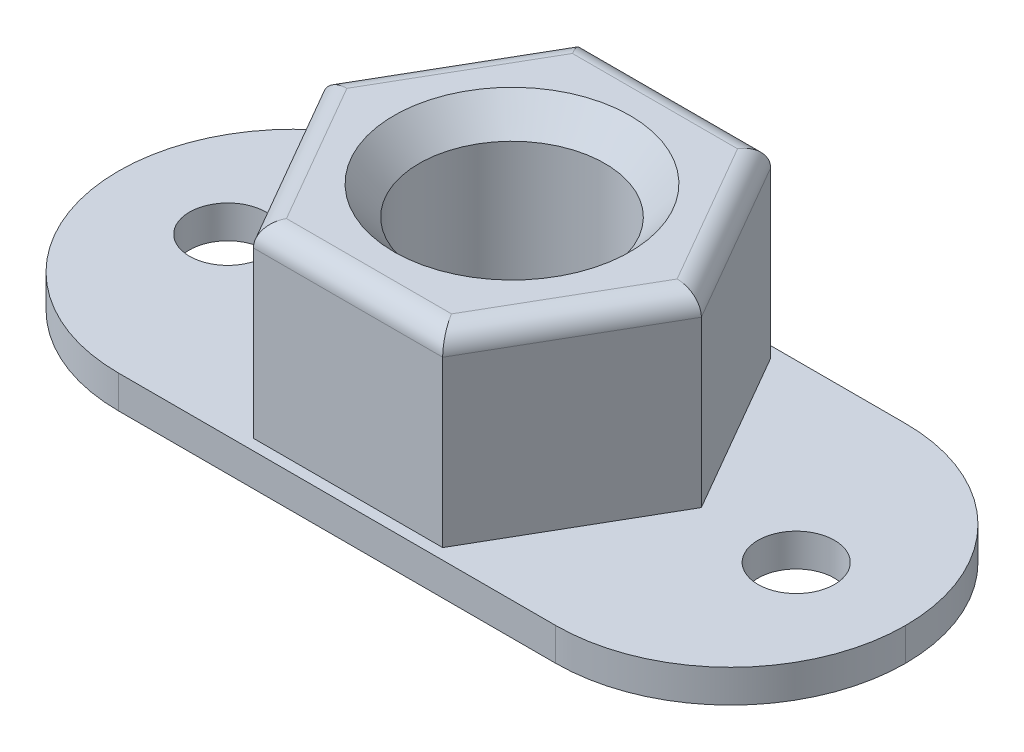
ISO-10303-21;
HEADER;
FILE_DESCRIPTION(('STEP AP214'),'2;1');
FILE_NAME('part.step','',(''),(''),'','','');
FILE_SCHEMA(('AUTOMOTIVE_DESIGN { 1 0 10303 214 1 1 1 1 }'));
ENDSEC;
DATA;
#1=APPLICATION_CONTEXT('core data for automotive mechanical design processes');
#2=APPLICATION_PROTOCOL_DEFINITION('international standard','automotive_design',2000,#1);
#3=PRODUCT_CONTEXT('',#1,'mechanical');
#4=PRODUCT('Part','Part','',(#3));
#5=PRODUCT_RELATED_PRODUCT_CATEGORY('part','',(#4));
#6=PRODUCT_DEFINITION_FORMATION('','',#4);
#7=PRODUCT_DEFINITION_CONTEXT('part definition',#1,'design');
#8=PRODUCT_DEFINITION('design','',#6,#7);
#9=PRODUCT_DEFINITION_SHAPE('','',#8);
#10=(LENGTH_UNIT() NAMED_UNIT(*) SI_UNIT(.MILLI.,.METRE.));
#11=(NAMED_UNIT(*) PLANE_ANGLE_UNIT() SI_UNIT($,.RADIAN.));
#12=(NAMED_UNIT(*) SI_UNIT($,.STERADIAN.) SOLID_ANGLE_UNIT());
#13=UNCERTAINTY_MEASURE_WITH_UNIT(LENGTH_MEASURE(1.E-05),#10,'distance_accuracy_value','');
#14=(GEOMETRIC_REPRESENTATION_CONTEXT(3) GLOBAL_UNCERTAINTY_ASSIGNED_CONTEXT((#13)) GLOBAL_UNIT_ASSIGNED_CONTEXT((#10,
#11,#12)) REPRESENTATION_CONTEXT('',''));
#15=CARTESIAN_POINT('',(0.,0.,0.));
#16=DIRECTION('',(0.,0.,1.));
#17=DIRECTION('',(1.,0.,0.));
#18=AXIS2_PLACEMENT_3D('',#15,#16,#17);
#19=CARTESIAN_POINT('',(6.87407664253899,13.49375,11.90625));
#20=DIRECTION('',(-0.866025403784438,0.,-0.5));
#21=DIRECTION('',(-0.5,0.,0.866025403784439));
#22=AXIS2_PLACEMENT_3D('',#19,#20,#21);
#23=PLANE('',#22);
#24=DIRECTION('',(0.,-1.,0.));
#25=VECTOR('',#24,1.);
#26=CARTESIAN_POINT('',(13.748153285078,13.49375,0.));
#27=LINE('',#26,#25);
#28=CARTESIAN_POINT('',(13.748153285078,11.96975,0.));
#29=VERTEX_POINT('',#28);
#30=CARTESIAN_POINT('',(13.748153285078,0.,0.));
#31=VERTEX_POINT('',#30);
#32=EDGE_CURVE('E155',#29,#31,#27,.T.);
#33=ORIENTED_EDGE('',*,*,#32,.F.);
#34=DIRECTION('',(0.5,0.,-0.866025403784439));
#35=VECTOR('',#34,1.);
#36=CARTESIAN_POINT('',(6.87407664253899,11.96975,11.90625));
#37=LINE('',#36,#35);
#38=CARTESIAN_POINT('',(6.87407664253899,11.96975,11.90625));
#39=VERTEX_POINT('',#38);
#40=EDGE_CURVE('E211',#29,#39,#37,.F.);
#41=ORIENTED_EDGE('',*,*,#40,.T.);
#42=DIRECTION('',(0.,-1.,0.));
#43=VECTOR('',#42,1.);
#44=CARTESIAN_POINT('',(6.87407664253899,13.49375,11.90625));
#45=LINE('',#44,#43);
#46=CARTESIAN_POINT('',(6.87407664253899,0.,11.90625));
#47=VERTEX_POINT('',#46);
#48=EDGE_CURVE('E165',#39,#47,#45,.T.);
#49=ORIENTED_EDGE('',*,*,#48,.T.);
#50=DIRECTION('',(0.5,0.,-0.866025403784438));
#51=VECTOR('',#50,1.);
#52=CARTESIAN_POINT('',(6.87407664253899,0.,11.90625));
#53=LINE('',#52,#51);
#54=EDGE_CURVE('E146',#47,#31,#53,.T.);
#55=ORIENTED_EDGE('',*,*,#54,.T.);
#56=EDGE_LOOP('',(#33,#41,#49,#55));
#57=FACE_BOUND('',#56,.T.);
#58=ADVANCED_FACE('F34',(#57),#23,.F.);
#59=CARTESIAN_POINT('',(13.748153285078,13.49375,0.));
#60=DIRECTION('',(-0.866025403784438,0.,0.5));
#61=DIRECTION('',(0.5,0.,0.866025403784439));
#62=AXIS2_PLACEMENT_3D('',#59,#60,#61);
#63=PLANE('',#62);
#64=DIRECTION('',(0.,-1.,0.));
#65=VECTOR('',#64,1.);
#66=CARTESIAN_POINT('',(6.87407664253898,13.49375,-11.90625));
#67=LINE('',#66,#65);
#68=CARTESIAN_POINT('',(6.87407664253898,11.96975,-11.90625));
#69=VERTEX_POINT('',#68);
#70=CARTESIAN_POINT('',(6.87407664253898,0.,-11.90625));
#71=VERTEX_POINT('',#70);
#72=EDGE_CURVE('E162',#69,#71,#67,.T.);
#73=ORIENTED_EDGE('',*,*,#72,.F.);
#74=DIRECTION('',(-0.5,0.,-0.866025403784439));
#75=VECTOR('',#74,1.);
#76=CARTESIAN_POINT('',(13.748153285078,11.96975,0.));
#77=LINE('',#76,#75);
#78=EDGE_CURVE('E158',#69,#29,#77,.F.);
#79=ORIENTED_EDGE('',*,*,#78,.T.);
#80=ORIENTED_EDGE('',*,*,#32,.T.);
#81=DIRECTION('',(-0.5,0.,-0.866025403784439));
#82=VECTOR('',#81,1.);
#83=CARTESIAN_POINT('',(13.748153285078,0.,0.));
#84=LINE('',#83,#82);
#85=EDGE_CURVE('E142',#31,#71,#84,.T.);
#86=ORIENTED_EDGE('',*,*,#85,.T.);
#87=EDGE_LOOP('',(#73,#79,#80,#86));
#88=FACE_BOUND('',#87,.T.);
#89=ADVANCED_FACE('F156',(#88),#63,.F.);
#90=CARTESIAN_POINT('',(6.87407664253898,13.49375,-11.90625));
#91=DIRECTION('',(0.,0.,1.));
#92=DIRECTION('',(1.,0.,0.));
#93=AXIS2_PLACEMENT_3D('',#90,#91,#92);
#94=PLANE('',#93);
#95=DIRECTION('',(0.,-1.,0.));
#96=VECTOR('',#95,1.);
#97=CARTESIAN_POINT('',(-6.87407664253898,13.49375,-11.90625));
#98=LINE('',#97,#96);
#99=CARTESIAN_POINT('',(-6.87407664253898,11.96975,-11.90625));
#100=VERTEX_POINT('',#99);
#101=CARTESIAN_POINT('',(-6.87407664253898,0.,-11.90625));
#102=VERTEX_POINT('',#101);
#103=EDGE_CURVE('E191',#100,#102,#98,.T.);
#104=ORIENTED_EDGE('',*,*,#103,.F.);
#105=DIRECTION('',(-1.,0.,0.));
#106=VECTOR('',#105,1.);
#107=CARTESIAN_POINT('',(6.87407664253898,11.96975,-11.90625));
#108=LINE('',#107,#106);
#109=EDGE_CURVE('E207',#100,#69,#108,.F.);
#110=ORIENTED_EDGE('',*,*,#109,.T.);
#111=ORIENTED_EDGE('',*,*,#72,.T.);
#112=DIRECTION('',(-1.,0.,0.));
#113=VECTOR('',#112,1.);
#114=CARTESIAN_POINT('',(6.87407664253898,0.,-11.90625));
#115=LINE('',#114,#113);
#116=EDGE_CURVE('E149',#71,#102,#115,.T.);
#117=ORIENTED_EDGE('',*,*,#116,.T.);
#118=EDGE_LOOP('',(#104,#110,#111,#117));
#119=FACE_BOUND('',#118,.T.);
#120=ADVANCED_FACE('F317',(#119),#94,.F.);
#121=CARTESIAN_POINT('',(-6.87407664253898,13.49375,-11.90625));
#122=DIRECTION('',(0.866025403784439,0.,0.5));
#123=DIRECTION('',(0.5,0.,-0.866025403784439));
#124=AXIS2_PLACEMENT_3D('',#121,#122,#123);
#125=PLANE('',#124);
#126=DIRECTION('',(0.,-1.,0.));
#127=VECTOR('',#126,1.);
#128=CARTESIAN_POINT('',(-13.748153285078,13.49375,0.));
#129=LINE('',#128,#127);
#130=CARTESIAN_POINT('',(-13.748153285078,11.96975,0.));
#131=VERTEX_POINT('',#130);
#132=CARTESIAN_POINT('',(-13.748153285078,0.,0.));
#133=VERTEX_POINT('',#132);
#134=EDGE_CURVE('E188',#131,#133,#129,.T.);
#135=ORIENTED_EDGE('',*,*,#134,.F.);
#136=DIRECTION('',(-0.5,0.,0.866025403784439));
#137=VECTOR('',#136,1.);
#138=CARTESIAN_POINT('',(-6.87407664253898,11.96975,-11.90625));
#139=LINE('',#138,#137);
#140=EDGE_CURVE('E217',#131,#100,#139,.F.);
#141=ORIENTED_EDGE('',*,*,#140,.T.);
#142=ORIENTED_EDGE('',*,*,#103,.T.);
#143=DIRECTION('',(-0.5,0.,0.866025403784439));
#144=VECTOR('',#143,1.);
#145=CARTESIAN_POINT('',(-6.87407664253898,0.,-11.90625));
#146=LINE('',#145,#144);
#147=EDGE_CURVE('E176',#102,#133,#146,.T.);
#148=ORIENTED_EDGE('',*,*,#147,.T.);
#149=EDGE_LOOP('',(#135,#141,#142,#148));
#150=FACE_BOUND('',#149,.T.);
#151=ADVANCED_FACE('F527',(#150),#125,.F.);
#152=CARTESIAN_POINT('',(-13.748153285078,13.49375,0.));
#153=DIRECTION('',(0.866025403784438,0.,-0.5));
#154=DIRECTION('',(-0.5,0.,-0.866025403784438));
#155=AXIS2_PLACEMENT_3D('',#152,#153,#154);
#156=PLANE('',#155);
#157=DIRECTION('',(0.,-1.,0.));
#158=VECTOR('',#157,1.);
#159=CARTESIAN_POINT('',(-6.87407664253898,13.49375,11.90625));
#160=LINE('',#159,#158);
#161=CARTESIAN_POINT('',(-6.87407664253898,11.96975,11.90625));
#162=VERTEX_POINT('',#161);
#163=CARTESIAN_POINT('',(-6.87407664253898,0.,11.90625));
#164=VERTEX_POINT('',#163);
#165=EDGE_CURVE('E185',#162,#164,#160,.T.);
#166=ORIENTED_EDGE('',*,*,#165,.F.);
#167=DIRECTION('',(0.5,0.,0.866025403784438));
#168=VECTOR('',#167,1.);
#169=CARTESIAN_POINT('',(-13.748153285078,11.96975,0.));
#170=LINE('',#169,#168);
#171=EDGE_CURVE('E215',#162,#131,#170,.F.);
#172=ORIENTED_EDGE('',*,*,#171,.T.);
#173=ORIENTED_EDGE('',*,*,#134,.T.);
#174=DIRECTION('',(0.5,0.,0.866025403784438));
#175=VECTOR('',#174,1.);
#176=CARTESIAN_POINT('',(-13.748153285078,0.,0.));
#177=LINE('',#176,#175);
#178=EDGE_CURVE('E179',#133,#164,#177,.T.);
#179=ORIENTED_EDGE('',*,*,#178,.T.);
#180=EDGE_LOOP('',(#166,#172,#173,#179));
#181=FACE_BOUND('',#180,.T.);
#182=ADVANCED_FACE('F309',(#181),#156,.F.);
#183=CARTESIAN_POINT('',(-6.87407664253898,13.49375,11.90625));
#184=DIRECTION('',(0.,0.,-1.));
#185=DIRECTION('',(-1.,0.,0.));
#186=AXIS2_PLACEMENT_3D('',#183,#184,#185);
#187=PLANE('',#186);
#188=ORIENTED_EDGE('',*,*,#48,.F.);
#189=DIRECTION('',(1.,0.,0.));
#190=VECTOR('',#189,1.);
#191=CARTESIAN_POINT('',(-6.87407664253898,11.96975,11.90625));
#192=LINE('',#191,#190);
#193=EDGE_CURVE('E213',#39,#162,#192,.F.);
#194=ORIENTED_EDGE('',*,*,#193,.T.);
#195=ORIENTED_EDGE('',*,*,#165,.T.);
#196=DIRECTION('',(1.,0.,0.));
#197=VECTOR('',#196,1.);
#198=CARTESIAN_POINT('',(-6.87407664253898,0.,11.90625));
#199=LINE('',#198,#197);
#200=EDGE_CURVE('E182',#164,#47,#199,.T.);
#201=ORIENTED_EDGE('',*,*,#200,.T.);
#202=EDGE_LOOP('',(#188,#194,#195,#201));
#203=FACE_BOUND('',#202,.T.);
#204=ADVANCED_FACE('F300',(#203),#187,.F.);
#205=CARTESIAN_POINT('',(0.,13.49375,0.));
#206=DIRECTION('',(0.,1.,0.));
#207=DIRECTION('',(0.,0.,1.));
#208=AXIS2_PLACEMENT_3D('',#205,#206,#207);
#209=PLANE('',#208);
#210=DIRECTION('',(-0.5,0.,-0.866025403784439));
#211=VECTOR('',#210,1.);
#212=CARTESIAN_POINT('',(5.5542539271715,13.49375,-11.14425));
#213=LINE('',#212,#211);
#214=CARTESIAN_POINT('',(11.988389664588,13.49375,0.));
#215=VERTEX_POINT('',#214);
#216=CARTESIAN_POINT('',(5.99419483229399,13.49375,-10.38225));
#217=VERTEX_POINT('',#216);
#218=EDGE_CURVE('E202',#215,#217,#213,.T.);
#219=ORIENTED_EDGE('',*,*,#218,.T.);
#220=DIRECTION('',(-1.,0.,0.));
#221=VECTOR('',#220,1.);
#222=CARTESIAN_POINT('',(-6.87407664253898,13.49375,-10.38225));
#223=LINE('',#222,#221);
#224=CARTESIAN_POINT('',(-5.99419483229399,13.49375,-10.38225));
#225=VERTEX_POINT('',#224);
#226=EDGE_CURVE('E204',#217,#225,#223,.T.);
#227=ORIENTED_EDGE('',*,*,#226,.T.);
#228=DIRECTION('',(-0.5,0.,0.866025403784439));
#229=VECTOR('',#228,1.);
#230=CARTESIAN_POINT('',(-12.4283305697105,13.49375,0.761999999999997));
#231=LINE('',#230,#229);
#232=CARTESIAN_POINT('',(-11.988389664588,13.49375,0.));
#233=VERTEX_POINT('',#232);
#234=EDGE_CURVE('E161',#225,#233,#231,.T.);
#235=ORIENTED_EDGE('',*,*,#234,.T.);
#236=DIRECTION('',(0.5,0.,0.866025403784438));
#237=VECTOR('',#236,1.);
#238=CARTESIAN_POINT('',(-5.55425392717149,13.49375,11.14425));
#239=LINE('',#238,#237);
#240=CARTESIAN_POINT('',(-5.99419483229399,13.49375,10.38225));
#241=VERTEX_POINT('',#240);
#242=EDGE_CURVE('E196',#233,#241,#239,.T.);
#243=ORIENTED_EDGE('',*,*,#242,.T.);
#244=DIRECTION('',(1.,0.,0.));
#245=VECTOR('',#244,1.);
#246=CARTESIAN_POINT('',(6.87407664253899,13.49375,10.38225));
#247=LINE('',#246,#245);
#248=CARTESIAN_POINT('',(5.994194832294,13.49375,10.38225));
#249=VERTEX_POINT('',#248);
#250=EDGE_CURVE('E198',#241,#249,#247,.T.);
#251=ORIENTED_EDGE('',*,*,#250,.T.);
#252=DIRECTION('',(0.5,0.,-0.866025403784439));
#253=VECTOR('',#252,1.);
#254=CARTESIAN_POINT('',(12.4283305697105,13.49375,-0.761999999999999));
#255=LINE('',#254,#253);
#256=EDGE_CURVE('E200',#249,#215,#255,.T.);
#257=ORIENTED_EDGE('',*,*,#256,.T.);
#258=EDGE_LOOP('',(#219,#227,#235,#243,#251,#257));
#259=FACE_BOUND('',#258,.T.);
#260=CARTESIAN_POINT('',(0.,13.49375,0.));
#261=DIRECTION('',(0.,1.,0.));
#262=DIRECTION('',(0.,0.,1.));
#263=AXIS2_PLACEMENT_3D('',#260,#261,#262);
#264=CIRCLE('',#263,8.5725);
#265=CARTESIAN_POINT('',(0.,13.49375,8.5725));
#266=VERTEX_POINT('',#265);
#267=EDGE_CURVE('E170',#266,#266,#264,.T.);
#268=ORIENTED_EDGE('',*,*,#267,.F.);
#269=EDGE_LOOP('',(#268));
#270=FACE_BOUND('',#269,.T.);
#271=ADVANCED_FACE('F297',(#259,#270),#209,.T.);
#272=CARTESIAN_POINT('',(0.,13.49375,0.));
#273=DIRECTION('',(0.,1.,0.));
#274=DIRECTION('',(0.,0.,1.));
#275=AXIS2_PLACEMENT_3D('',#272,#273,#274);
#276=CYLINDRICAL_SURFACE('',#275,6.74624);
#277=CARTESIAN_POINT('',(0.,0.,0.));
#278=DIRECTION('',(0.,1.,0.));
#279=DIRECTION('',(0.,0.,1.));
#280=AXIS2_PLACEMENT_3D('',#277,#278,#279);
#281=CIRCLE('',#280,6.74623999999999);
#282=CARTESIAN_POINT('',(0.,0.,6.74623999999999));
#283=VERTEX_POINT('',#282);
#284=EDGE_CURVE('E173',#283,#283,#281,.T.);
#285=ORIENTED_EDGE('',*,*,#284,.F.);
#286=EDGE_LOOP('',(#285));
#287=FACE_BOUND('',#286,.T.);
#288=CARTESIAN_POINT('',(0.,11.3928781926286,0.));
#289=DIRECTION('',(0.,1.,0.));
#290=DIRECTION('',(0.,0.,1.));
#291=AXIS2_PLACEMENT_3D('',#288,#289,#290);
#292=CIRCLE('',#291,6.74624);
#293=CARTESIAN_POINT('',(0.,11.3928781926286,6.74624));
#294=VERTEX_POINT('',#293);
#295=EDGE_CURVE('E167',#294,#294,#292,.T.);
#296=ORIENTED_EDGE('',*,*,#295,.T.);
#297=EDGE_LOOP('',(#296));
#298=FACE_BOUND('',#297,.T.);
#299=ADVANCED_FACE('F299',(#287,#298),#276,.F.);
#300=CARTESIAN_POINT('',(0.,13.49375,0.));
#301=DIRECTION('',(0.,1.,0.));
#302=DIRECTION('',(0.,0.,1.));
#303=AXIS2_PLACEMENT_3D('',#300,#301,#302);
#304=CONICAL_SURFACE('',#303,8.5725,0.715584993317675);
#305=ORIENTED_EDGE('',*,*,#295,.F.);
#306=EDGE_LOOP('',(#305));
#307=FACE_BOUND('',#306,.T.);
#308=ORIENTED_EDGE('',*,*,#267,.T.);
#309=EDGE_LOOP('',(#308));
#310=FACE_BOUND('',#309,.T.);
#311=ADVANCED_FACE('F295',(#307,#310),#304,.F.);
#312=CARTESIAN_POINT('',(0.,11.96975,10.38225));
#313=DIRECTION('',(-1.,0.,0.));
#314=DIRECTION('',(0.,0.,1.));
#315=AXIS2_PLACEMENT_3D('',#312,#313,#314);
#316=CYLINDRICAL_SURFACE('',#315,1.524);
#317=CARTESIAN_POINT('',(-5.99419483229399,11.96975,10.38225));
#318=DIRECTION('',(-0.866025403784439,0.,-0.5));
#319=DIRECTION('',(0.5,0.,-0.866025403784439));
#320=AXIS2_PLACEMENT_3D('',#317,#318,#319);
#321=ELLIPSE('',#320,1.75976362048998,1.524);
#322=EDGE_CURVE('E231',#162,#241,#321,.T.);
#323=ORIENTED_EDGE('',*,*,#322,.F.);
#324=ORIENTED_EDGE('',*,*,#193,.F.);
#325=CARTESIAN_POINT('',(5.994194832294,11.96975,10.38225));
#326=DIRECTION('',(-0.866025403784439,0.,0.5));
#327=DIRECTION('',(-0.5,0.,-0.866025403784439));
#328=AXIS2_PLACEMENT_3D('',#325,#326,#327);
#329=ELLIPSE('',#328,1.75976362048998,1.524);
#330=EDGE_CURVE('E234',#249,#39,#329,.F.);
#331=ORIENTED_EDGE('',*,*,#330,.F.);
#332=ORIENTED_EDGE('',*,*,#250,.F.);
#333=EDGE_LOOP('',(#323,#324,#331,#332));
#334=FACE_BOUND('',#333,.T.);
#335=ADVANCED_FACE('F341',(#334),#316,.T.);
#336=CARTESIAN_POINT('',(8.99129224844099,11.96975,5.191125));
#337=DIRECTION('',(-0.5,0.,0.866025403784439));
#338=DIRECTION('',(0.866025403784439,0.,0.5));
#339=AXIS2_PLACEMENT_3D('',#336,#337,#338);
#340=CYLINDRICAL_SURFACE('',#339,1.524);
#341=ORIENTED_EDGE('',*,*,#330,.T.);
#342=ORIENTED_EDGE('',*,*,#40,.F.);
#343=CARTESIAN_POINT('',(11.988389664588,11.96975,0.));
#344=DIRECTION('',(0.,0.,1.));
#345=DIRECTION('',(-1.,0.,0.));
#346=AXIS2_PLACEMENT_3D('',#343,#344,#345);
#347=ELLIPSE('',#346,1.75976362048998,1.524);
#348=EDGE_CURVE('E228',#215,#29,#347,.F.);
#349=ORIENTED_EDGE('',*,*,#348,.F.);
#350=ORIENTED_EDGE('',*,*,#256,.F.);
#351=EDGE_LOOP('',(#341,#342,#349,#350));
#352=FACE_BOUND('',#351,.T.);
#353=ADVANCED_FACE('F337',(#352),#340,.T.);
#354=CARTESIAN_POINT('',(-8.99129224844098,11.96975,5.191125));
#355=DIRECTION('',(-0.5,0.,-0.866025403784438));
#356=DIRECTION('',(-0.866025403784438,0.,0.5));
#357=AXIS2_PLACEMENT_3D('',#354,#355,#356);
#358=CYLINDRICAL_SURFACE('',#357,1.524);
#359=ORIENTED_EDGE('',*,*,#322,.T.);
#360=ORIENTED_EDGE('',*,*,#242,.F.);
#361=CARTESIAN_POINT('',(-11.988389664588,11.96975,0.));
#362=DIRECTION('',(0.,0.,-1.));
#363=DIRECTION('',(1.,0.,0.));
#364=AXIS2_PLACEMENT_3D('',#361,#362,#363);
#365=ELLIPSE('',#364,1.75976362048998,1.524);
#366=EDGE_CURVE('E225',#131,#233,#365,.T.);
#367=ORIENTED_EDGE('',*,*,#366,.F.);
#368=ORIENTED_EDGE('',*,*,#171,.F.);
#369=EDGE_LOOP('',(#359,#360,#367,#368));
#370=FACE_BOUND('',#369,.T.);
#371=ADVANCED_FACE('F333',(#370),#358,.T.);
#372=CARTESIAN_POINT('',(8.99129224844099,11.96975,-5.191125));
#373=DIRECTION('',(0.5,0.,0.866025403784439));
#374=DIRECTION('',(0.866025403784438,0.,-0.5));
#375=AXIS2_PLACEMENT_3D('',#372,#373,#374);
#376=CYLINDRICAL_SURFACE('',#375,1.524);
#377=ORIENTED_EDGE('',*,*,#348,.T.);
#378=ORIENTED_EDGE('',*,*,#78,.F.);
#379=CARTESIAN_POINT('',(5.99419483229399,11.96975,-10.38225));
#380=DIRECTION('',(0.866025403784439,0.,0.5));
#381=DIRECTION('',(-0.5,0.,0.866025403784439));
#382=AXIS2_PLACEMENT_3D('',#379,#380,#381);
#383=ELLIPSE('',#382,1.75976362048998,1.524);
#384=EDGE_CURVE('E222',#217,#69,#383,.F.);
#385=ORIENTED_EDGE('',*,*,#384,.F.);
#386=ORIENTED_EDGE('',*,*,#218,.F.);
#387=EDGE_LOOP('',(#377,#378,#385,#386));
#388=FACE_BOUND('',#387,.T.);
#389=ADVANCED_FACE('F329',(#388),#376,.T.);
#390=CARTESIAN_POINT('',(-8.99129224844099,11.96975,-5.191125));
#391=DIRECTION('',(0.5,0.,-0.866025403784439));
#392=DIRECTION('',(-0.866025403784439,0.,-0.5));
#393=AXIS2_PLACEMENT_3D('',#390,#391,#392);
#394=CYLINDRICAL_SURFACE('',#393,1.524);
#395=ORIENTED_EDGE('',*,*,#366,.T.);
#396=ORIENTED_EDGE('',*,*,#234,.F.);
#397=CARTESIAN_POINT('',(-5.99419483229399,11.96975,-10.38225));
#398=DIRECTION('',(0.866025403784439,0.,-0.5));
#399=DIRECTION('',(-0.5,0.,-0.866025403784439));
#400=AXIS2_PLACEMENT_3D('',#397,#398,#399);
#401=ELLIPSE('',#400,1.75976362048998,1.524);
#402=EDGE_CURVE('E220',#100,#225,#401,.T.);
#403=ORIENTED_EDGE('',*,*,#402,.F.);
#404=ORIENTED_EDGE('',*,*,#140,.F.);
#405=EDGE_LOOP('',(#395,#396,#403,#404));
#406=FACE_BOUND('',#405,.T.);
#407=ADVANCED_FACE('F325',(#406),#394,.T.);
#408=CARTESIAN_POINT('',(0.,11.96975,-10.38225));
#409=DIRECTION('',(1.,0.,0.));
#410=DIRECTION('',(0.,0.,-1.));
#411=AXIS2_PLACEMENT_3D('',#408,#409,#410);
#412=CYLINDRICAL_SURFACE('',#411,1.524);
#413=ORIENTED_EDGE('',*,*,#384,.T.);
#414=ORIENTED_EDGE('',*,*,#109,.F.);
#415=ORIENTED_EDGE('',*,*,#402,.T.);
#416=ORIENTED_EDGE('',*,*,#226,.F.);
#417=EDGE_LOOP('',(#413,#414,#415,#416));
#418=FACE_BOUND('',#417,.T.);
#419=ADVANCED_FACE('F321',(#418),#412,.T.);
#420=CARTESIAN_POINT('',(0.,-2.38125,0.));
#421=DIRECTION('',(0.,1.,0.));
#422=DIRECTION('',(0.,0.,1.));
#423=AXIS2_PLACEMENT_3D('',#420,#421,#422);
#424=PLANE('',#423);
#425=CARTESIAN_POINT('',(-20.6375,-2.38125,0.));
#426=DIRECTION('',(0.,-1.,0.));
#427=DIRECTION('',(0.,0.,-1.));
#428=AXIS2_PLACEMENT_3D('',#425,#426,#427);
#429=CIRCLE('',#428,2.778125);
#430=CARTESIAN_POINT('',(-20.6375,-2.38125,-2.778125));
#431=VERTEX_POINT('',#430);
#432=EDGE_CURVE('E266',#431,#431,#429,.T.);
#433=ORIENTED_EDGE('',*,*,#432,.F.);
#434=EDGE_LOOP('',(#433));
#435=FACE_BOUND('',#434,.T.);
#436=CARTESIAN_POINT('',(20.6375,-2.38125,0.));
#437=DIRECTION('',(0.,-1.,0.));
#438=DIRECTION('',(0.,0.,-1.));
#439=AXIS2_PLACEMENT_3D('',#436,#437,#438);
#440=CIRCLE('',#439,2.778125);
#441=CARTESIAN_POINT('',(20.6375,-2.38125,-2.778125));
#442=VERTEX_POINT('',#441);
#443=EDGE_CURVE('E272',#442,#442,#440,.T.);
#444=ORIENTED_EDGE('',*,*,#443,.F.);
#445=EDGE_LOOP('',(#444));
#446=FACE_BOUND('',#445,.T.);
#447=CARTESIAN_POINT('',(0.,-2.38125,0.));
#448=DIRECTION('',(0.,-1.,0.));
#449=DIRECTION('',(0.,0.,-1.));
#450=AXIS2_PLACEMENT_3D('',#447,#448,#449);
#451=CIRCLE('',#450,9.525);
#452=CARTESIAN_POINT('',(0.,-2.38125,-9.525));
#453=VERTEX_POINT('',#452);
#454=EDGE_CURVE('E270',#453,#453,#451,.T.);
#455=ORIENTED_EDGE('',*,*,#454,.F.);
#456=EDGE_LOOP('',(#455));
#457=FACE_BOUND('',#456,.T.);
#458=CARTESIAN_POINT('',(-15.875,-2.38125,0.));
#459=DIRECTION('',(0.,1.,0.));
#460=DIRECTION('',(0.,0.,1.));
#461=AXIS2_PLACEMENT_3D('',#458,#459,#460);
#462=CIRCLE('',#461,12.7);
#463=CARTESIAN_POINT('',(-15.875,-2.38125,12.7));
#464=VERTEX_POINT('',#463);
#465=CARTESIAN_POINT('',(-28.575,-2.38125,0.));
#466=VERTEX_POINT('',#465);
#467=EDGE_CURVE('E51',#464,#466,#462,.F.);
#468=ORIENTED_EDGE('',*,*,#467,.T.);
#469=CARTESIAN_POINT('',(-15.875,-2.38125,0.));
#470=DIRECTION('',(0.,1.,0.));
#471=DIRECTION('',(0.,0.,1.));
#472=AXIS2_PLACEMENT_3D('',#469,#470,#471);
#473=CIRCLE('',#472,12.7);
#474=CARTESIAN_POINT('',(-15.875,-2.38125,-12.7));
#475=VERTEX_POINT('',#474);
#476=EDGE_CURVE('E255',#466,#475,#473,.F.);
#477=ORIENTED_EDGE('',*,*,#476,.T.);
#478=DIRECTION('',(1.,0.,0.));
#479=VECTOR('',#478,1.);
#480=CARTESIAN_POINT('',(-28.575,-2.38125,-12.7));
#481=LINE('',#480,#479);
#482=CARTESIAN_POINT('',(15.875,-2.38125,-12.7));
#483=VERTEX_POINT('',#482);
#484=EDGE_CURVE('E223',#475,#483,#481,.T.);
#485=ORIENTED_EDGE('',*,*,#484,.T.);
#486=CARTESIAN_POINT('',(15.875,-2.38125,0.));
#487=DIRECTION('',(0.,1.,0.));
#488=DIRECTION('',(0.,0.,1.));
#489=AXIS2_PLACEMENT_3D('',#486,#487,#488);
#490=CIRCLE('',#489,12.7);
#491=CARTESIAN_POINT('',(28.575,-2.38125,0.));
#492=VERTEX_POINT('',#491);
#493=EDGE_CURVE('E252',#483,#492,#490,.F.);
#494=ORIENTED_EDGE('',*,*,#493,.T.);
#495=CARTESIAN_POINT('',(15.875,-2.38125,0.));
#496=DIRECTION('',(0.,1.,0.));
#497=DIRECTION('',(0.,0.,1.));
#498=AXIS2_PLACEMENT_3D('',#495,#496,#497);
#499=CIRCLE('',#498,12.7);
#500=CARTESIAN_POINT('',(15.875,-2.38125,12.7));
#501=VERTEX_POINT('',#500);
#502=EDGE_CURVE('E250',#492,#501,#499,.F.);
#503=ORIENTED_EDGE('',*,*,#502,.T.);
#504=DIRECTION('',(-1.,0.,0.));
#505=VECTOR('',#504,1.);
#506=CARTESIAN_POINT('',(-28.575,-2.38125,12.7));
#507=LINE('',#506,#505);
#508=EDGE_CURVE('E284',#501,#464,#507,.T.);
#509=ORIENTED_EDGE('',*,*,#508,.T.);
#510=EDGE_LOOP('',(#468,#477,#485,#494,#503,#509));
#511=FACE_BOUND('',#510,.T.);
#512=ADVANCED_FACE('F324',(#435,#446,#457,#511),#424,.F.);
#513=CARTESIAN_POINT('',(-28.575,-2.38125,-12.7));
#514=DIRECTION('',(0.,0.,1.));
#515=DIRECTION('',(1.,0.,0.));
#516=AXIS2_PLACEMENT_3D('',#513,#514,#515);
#517=PLANE('',#516);
#518=ORIENTED_EDGE('',*,*,#484,.F.);
#519=DIRECTION('',(0.,1.,0.));
#520=VECTOR('',#519,1.);
#521=CARTESIAN_POINT('',(-15.875,-2.38125,-12.7));
#522=LINE('',#521,#520);
#523=CARTESIAN_POINT('',(-15.875,0.,-12.7));
#524=VERTEX_POINT('',#523);
#525=EDGE_CURVE('E239',#475,#524,#522,.T.);
#526=ORIENTED_EDGE('',*,*,#525,.T.);
#527=DIRECTION('',(1.,0.,0.));
#528=VECTOR('',#527,1.);
#529=CARTESIAN_POINT('',(-28.575,0.,-12.7));
#530=LINE('',#529,#528);
#531=CARTESIAN_POINT('',(15.875,0.,-12.7));
#532=VERTEX_POINT('',#531);
#533=EDGE_CURVE('E286',#524,#532,#530,.T.);
#534=ORIENTED_EDGE('',*,*,#533,.T.);
#535=DIRECTION('',(0.,1.,0.));
#536=VECTOR('',#535,1.);
#537=CARTESIAN_POINT('',(15.875,-2.38125,-12.7));
#538=LINE('',#537,#536);
#539=EDGE_CURVE('E219',#532,#483,#538,.F.);
#540=ORIENTED_EDGE('',*,*,#539,.T.);
#541=EDGE_LOOP('',(#518,#526,#534,#540));
#542=FACE_BOUND('',#541,.T.);
#543=ADVANCED_FACE('F371',(#542),#517,.F.);
#544=CARTESIAN_POINT('',(-28.575,-2.38125,12.7));
#545=DIRECTION('',(0.,0.,-1.));
#546=DIRECTION('',(-1.,0.,0.));
#547=AXIS2_PLACEMENT_3D('',#544,#545,#546);
#548=PLANE('',#547);
#549=DIRECTION('',(-1.,0.,0.));
#550=VECTOR('',#549,1.);
#551=CARTESIAN_POINT('',(-28.575,0.,12.7));
#552=LINE('',#551,#550);
#553=CARTESIAN_POINT('',(15.875,0.,12.7));
#554=VERTEX_POINT('',#553);
#555=CARTESIAN_POINT('',(-15.875,0.,12.7));
#556=VERTEX_POINT('',#555);
#557=EDGE_CURVE('E261',#554,#556,#552,.T.);
#558=ORIENTED_EDGE('',*,*,#557,.T.);
#559=DIRECTION('',(0.,1.,0.));
#560=VECTOR('',#559,1.);
#561=CARTESIAN_POINT('',(-15.875,-2.38125,12.7));
#562=LINE('',#561,#560);
#563=EDGE_CURVE('E11',#556,#464,#562,.F.);
#564=ORIENTED_EDGE('',*,*,#563,.T.);
#565=ORIENTED_EDGE('',*,*,#508,.F.);
#566=DIRECTION('',(0.,1.,0.));
#567=VECTOR('',#566,1.);
#568=CARTESIAN_POINT('',(15.875,-2.38125,12.7));
#569=LINE('',#568,#567);
#570=EDGE_CURVE('E43',#501,#554,#569,.T.);
#571=ORIENTED_EDGE('',*,*,#570,.T.);
#572=EDGE_LOOP('',(#558,#564,#565,#571));
#573=FACE_BOUND('',#572,.T.);
#574=ADVANCED_FACE('F380',(#573),#548,.F.);
#575=CARTESIAN_POINT('',(0.,0.,0.));
#576=DIRECTION('',(0.,1.,0.));
#577=DIRECTION('',(0.,0.,1.));
#578=AXIS2_PLACEMENT_3D('',#575,#576,#577);
#579=PLANE('',#578);
#580=CARTESIAN_POINT('',(-20.6375,0.,0.));
#581=DIRECTION('',(0.,1.,0.));
#582=DIRECTION('',(0.,0.,1.));
#583=AXIS2_PLACEMENT_3D('',#580,#581,#582);
#584=CIRCLE('',#583,2.778125);
#585=CARTESIAN_POINT('',(-20.6375,0.,2.778125));
#586=VERTEX_POINT('',#585);
#587=EDGE_CURVE('E38',#586,#586,#584,.T.);
#588=ORIENTED_EDGE('',*,*,#587,.F.);
#589=EDGE_LOOP('',(#588));
#590=FACE_BOUND('',#589,.T.);
#591=CARTESIAN_POINT('',(20.6375,0.,0.));
#592=DIRECTION('',(0.,1.,0.));
#593=DIRECTION('',(0.,0.,1.));
#594=AXIS2_PLACEMENT_3D('',#591,#592,#593);
#595=CIRCLE('',#594,2.778125);
#596=CARTESIAN_POINT('',(20.6375,0.,2.778125));
#597=VERTEX_POINT('',#596);
#598=EDGE_CURVE('E264',#597,#597,#595,.T.);
#599=ORIENTED_EDGE('',*,*,#598,.F.);
#600=EDGE_LOOP('',(#599));
#601=FACE_BOUND('',#600,.T.);
#602=ORIENTED_EDGE('',*,*,#533,.F.);
#603=CARTESIAN_POINT('',(-15.875,0.,0.));
#604=DIRECTION('',(0.,1.,0.));
#605=DIRECTION('',(0.,0.,1.));
#606=AXIS2_PLACEMENT_3D('',#603,#604,#605);
#607=CIRCLE('',#606,12.7);
#608=CARTESIAN_POINT('',(-28.575,0.,0.));
#609=VERTEX_POINT('',#608);
#610=EDGE_CURVE('E248',#524,#609,#607,.T.);
#611=ORIENTED_EDGE('',*,*,#610,.T.);
#612=CARTESIAN_POINT('',(-15.875,0.,0.));
#613=DIRECTION('',(0.,1.,0.));
#614=DIRECTION('',(0.,0.,1.));
#615=AXIS2_PLACEMENT_3D('',#612,#613,#614);
#616=CIRCLE('',#615,12.7);
#617=EDGE_CURVE('E246',#609,#556,#616,.T.);
#618=ORIENTED_EDGE('',*,*,#617,.T.);
#619=ORIENTED_EDGE('',*,*,#557,.F.);
#620=CARTESIAN_POINT('',(15.875,0.,0.));
#621=DIRECTION('',(0.,1.,0.));
#622=DIRECTION('',(0.,0.,1.));
#623=AXIS2_PLACEMENT_3D('',#620,#621,#622);
#624=CIRCLE('',#623,12.7);
#625=CARTESIAN_POINT('',(28.575,0.,0.));
#626=VERTEX_POINT('',#625);
#627=EDGE_CURVE('E242',#554,#626,#624,.T.);
#628=ORIENTED_EDGE('',*,*,#627,.T.);
#629=CARTESIAN_POINT('',(15.875,0.,0.));
#630=DIRECTION('',(0.,1.,0.));
#631=DIRECTION('',(0.,0.,1.));
#632=AXIS2_PLACEMENT_3D('',#629,#630,#631);
#633=CIRCLE('',#632,12.7);
#634=EDGE_CURVE('E244',#626,#532,#633,.T.);
#635=ORIENTED_EDGE('',*,*,#634,.T.);
#636=EDGE_LOOP('',(#602,#611,#618,#619,#628,#635));
#637=FACE_BOUND('',#636,.T.);
#638=ORIENTED_EDGE('',*,*,#54,.F.);
#639=ORIENTED_EDGE('',*,*,#200,.F.);
#640=ORIENTED_EDGE('',*,*,#178,.F.);
#641=ORIENTED_EDGE('',*,*,#147,.F.);
#642=ORIENTED_EDGE('',*,*,#116,.F.);
#643=ORIENTED_EDGE('',*,*,#85,.F.);
#644=EDGE_LOOP('',(#638,#639,#640,#641,#642,#643));
#645=FACE_BOUND('',#644,.T.);
#646=ADVANCED_FACE('F144',(#590,#601,#637,#645),#579,.T.);
#647=CARTESIAN_POINT('',(-15.875,-2.38125,0.));
#648=DIRECTION('',(0.,1.,0.));
#649=DIRECTION('',(0.,0.,1.));
#650=AXIS2_PLACEMENT_3D('',#647,#648,#649);
#651=CYLINDRICAL_SURFACE('',#650,12.7);
#652=DIRECTION('',(0.,1.,0.));
#653=VECTOR('',#652,1.);
#654=CARTESIAN_POINT('',(-28.575,-2.38125,0.));
#655=LINE('',#654,#653);
#656=EDGE_CURVE('E258',#466,#609,#655,.T.);
#657=ORIENTED_EDGE('',*,*,#656,.F.);
#658=ORIENTED_EDGE('',*,*,#467,.F.);
#659=ORIENTED_EDGE('',*,*,#563,.F.);
#660=ORIENTED_EDGE('',*,*,#617,.F.);
#661=EDGE_LOOP('',(#657,#658,#659,#660));
#662=FACE_BOUND('',#661,.T.);
#663=ADVANCED_FACE('F349',(#662),#651,.T.);
#664=CARTESIAN_POINT('',(-15.875,-2.38125,0.));
#665=DIRECTION('',(0.,1.,0.));
#666=DIRECTION('',(0.,0.,1.));
#667=AXIS2_PLACEMENT_3D('',#664,#665,#666);
#668=CYLINDRICAL_SURFACE('',#667,12.7);
#669=ORIENTED_EDGE('',*,*,#476,.F.);
#670=ORIENTED_EDGE('',*,*,#656,.T.);
#671=ORIENTED_EDGE('',*,*,#610,.F.);
#672=ORIENTED_EDGE('',*,*,#525,.F.);
#673=EDGE_LOOP('',(#669,#670,#671,#672));
#674=FACE_BOUND('',#673,.T.);
#675=ADVANCED_FACE('F346',(#674),#668,.T.);
#676=CARTESIAN_POINT('',(15.875,-2.38125,0.));
#677=DIRECTION('',(0.,1.,0.));
#678=DIRECTION('',(0.,0.,1.));
#679=AXIS2_PLACEMENT_3D('',#676,#677,#678);
#680=CYLINDRICAL_SURFACE('',#679,12.7);
#681=ORIENTED_EDGE('',*,*,#570,.F.);
#682=ORIENTED_EDGE('',*,*,#502,.F.);
#683=DIRECTION('',(0.,1.,0.));
#684=VECTOR('',#683,1.);
#685=CARTESIAN_POINT('',(28.575,-2.38125,0.));
#686=LINE('',#685,#684);
#687=EDGE_CURVE('E262',#626,#492,#686,.F.);
#688=ORIENTED_EDGE('',*,*,#687,.F.);
#689=ORIENTED_EDGE('',*,*,#627,.F.);
#690=EDGE_LOOP('',(#681,#682,#688,#689));
#691=FACE_BOUND('',#690,.T.);
#692=ADVANCED_FACE('F36',(#691),#680,.T.);
#693=CARTESIAN_POINT('',(15.875,-2.38125,0.));
#694=DIRECTION('',(0.,1.,0.));
#695=DIRECTION('',(0.,0.,1.));
#696=AXIS2_PLACEMENT_3D('',#693,#694,#695);
#697=CYLINDRICAL_SURFACE('',#696,12.7);
#698=ORIENTED_EDGE('',*,*,#493,.F.);
#699=ORIENTED_EDGE('',*,*,#539,.F.);
#700=ORIENTED_EDGE('',*,*,#634,.F.);
#701=ORIENTED_EDGE('',*,*,#687,.T.);
#702=EDGE_LOOP('',(#698,#699,#700,#701));
#703=FACE_BOUND('',#702,.T.);
#704=ADVANCED_FACE('F353',(#703),#697,.T.);
#705=CARTESIAN_POINT('',(0.,0.,0.));
#706=DIRECTION('',(0.,1.,0.));
#707=DIRECTION('',(0.,0.,1.));
#708=AXIS2_PLACEMENT_3D('',#705,#706,#707);
#709=PLANE('',#708);
#710=ORIENTED_EDGE('',*,*,#284,.T.);
#711=EDGE_LOOP('',(#710));
#712=FACE_BOUND('',#711,.T.);
#713=CARTESIAN_POINT('',(0.,0.,0.));
#714=DIRECTION('',(0.,1.,0.));
#715=DIRECTION('',(0.,0.,1.));
#716=AXIS2_PLACEMENT_3D('',#713,#714,#715);
#717=CIRCLE('',#716,9.525);
#718=CARTESIAN_POINT('',(0.,0.,9.525));
#719=VERTEX_POINT('',#718);
#720=EDGE_CURVE('E281',#719,#719,#717,.F.);
#721=ORIENTED_EDGE('',*,*,#720,.T.);
#722=EDGE_LOOP('',(#721));
#723=FACE_BOUND('',#722,.T.);
#724=ADVANCED_FACE('F355',(#712,#723),#709,.F.);
#725=CARTESIAN_POINT('',(0.,26.9407683632075,0.));
#726=DIRECTION('',(0.,-1.,0.));
#727=DIRECTION('',(0.,0.,-1.));
#728=AXIS2_PLACEMENT_3D('',#725,#726,#727);
#729=CYLINDRICAL_SURFACE('',#728,9.525);
#730=ORIENTED_EDGE('',*,*,#454,.T.);
#731=EDGE_LOOP('',(#730));
#732=FACE_BOUND('',#731,.T.);
#733=ORIENTED_EDGE('',*,*,#720,.F.);
#734=EDGE_LOOP('',(#733));
#735=FACE_BOUND('',#734,.T.);
#736=ADVANCED_FACE('F361',(#732,#735),#729,.F.);
#737=CARTESIAN_POINT('',(20.6375,13.49375,0.));
#738=DIRECTION('',(0.,-1.,0.));
#739=DIRECTION('',(0.,0.,-1.));
#740=AXIS2_PLACEMENT_3D('',#737,#738,#739);
#741=CYLINDRICAL_SURFACE('',#740,2.778125);
#742=ORIENTED_EDGE('',*,*,#598,.T.);
#743=EDGE_LOOP('',(#742));
#744=FACE_BOUND('',#743,.T.);
#745=ORIENTED_EDGE('',*,*,#443,.T.);
#746=EDGE_LOOP('',(#745));
#747=FACE_BOUND('',#746,.T.);
#748=ADVANCED_FACE('F481',(#744,#747),#741,.F.);
#749=CARTESIAN_POINT('',(-20.6375,13.49375,0.));
#750=DIRECTION('',(0.,-1.,0.));
#751=DIRECTION('',(0.,0.,-1.));
#752=AXIS2_PLACEMENT_3D('',#749,#750,#751);
#753=CYLINDRICAL_SURFACE('',#752,2.778125);
#754=ORIENTED_EDGE('',*,*,#587,.T.);
#755=EDGE_LOOP('',(#754));
#756=FACE_BOUND('',#755,.T.);
#757=ORIENTED_EDGE('',*,*,#432,.T.);
#758=EDGE_LOOP('',(#757));
#759=FACE_BOUND('',#758,.T.);
#760=ADVANCED_FACE('F492',(#756,#759),#753,.F.);
#761=CLOSED_SHELL('',(#58,#89,#120,#151,#182,#204,#271,#299,#311,#335,#353,#371,#389,#407,#419,
#512,#543,#574,#646,#663,#675,#692,#704,#724,#736,#748,#760));
#762=MANIFOLD_SOLID_BREP('B2',#761);
#763=ADVANCED_BREP_SHAPE_REPRESENTATION('',(#18,#762),#14);
#764=SHAPE_DEFINITION_REPRESENTATION(#9,#763);
ENDSEC;
END-ISO-10303-21;
